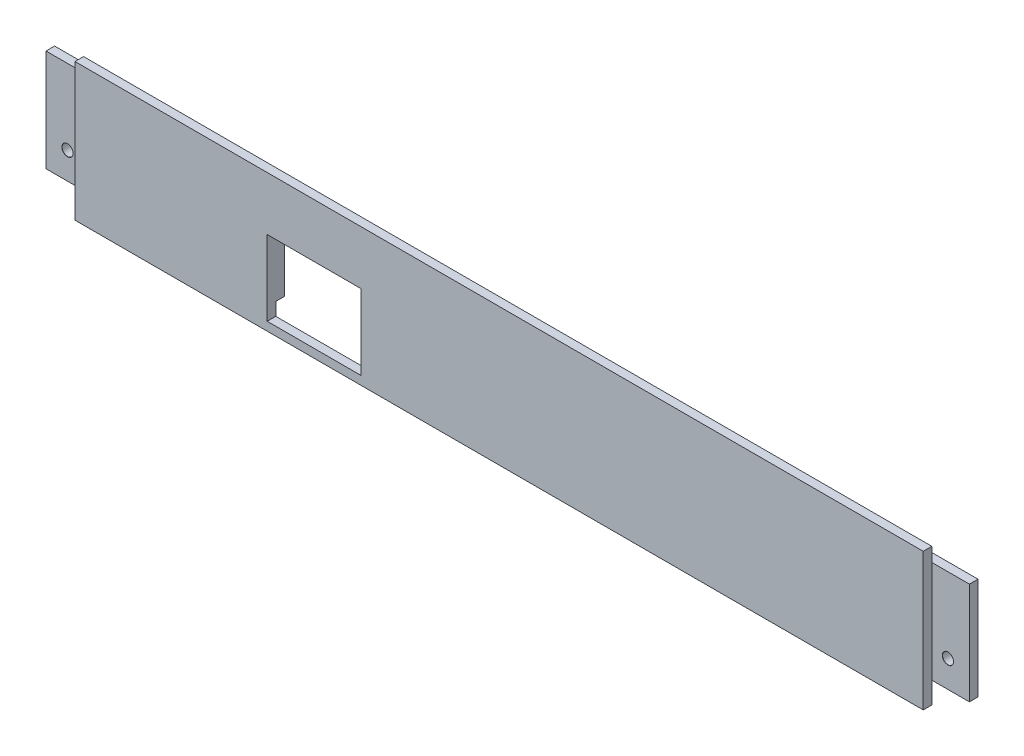
ISO-10303-21;
HEADER;
FILE_DESCRIPTION(('STEP AP214'),'2;1');
FILE_NAME('part.step','',(''),(''),'','','');
FILE_SCHEMA(('AUTOMOTIVE_DESIGN { 1 0 10303 214 1 1 1 1 }'));
ENDSEC;
DATA;
#1=APPLICATION_CONTEXT('core data for automotive mechanical design processes');
#2=APPLICATION_PROTOCOL_DEFINITION('international standard','automotive_design',2000,#1);
#3=PRODUCT_CONTEXT('',#1,'mechanical');
#4=PRODUCT('Part','Part','',(#3));
#5=PRODUCT_RELATED_PRODUCT_CATEGORY('part','',(#4));
#6=PRODUCT_DEFINITION_FORMATION('','',#4);
#7=PRODUCT_DEFINITION_CONTEXT('part definition',#1,'design');
#8=PRODUCT_DEFINITION('design','',#6,#7);
#9=PRODUCT_DEFINITION_SHAPE('','',#8);
#10=(LENGTH_UNIT() NAMED_UNIT(*) SI_UNIT(.MILLI.,.METRE.));
#11=(NAMED_UNIT(*) PLANE_ANGLE_UNIT() SI_UNIT($,.RADIAN.));
#12=(NAMED_UNIT(*) SI_UNIT($,.STERADIAN.) SOLID_ANGLE_UNIT());
#13=UNCERTAINTY_MEASURE_WITH_UNIT(LENGTH_MEASURE(1.E-05),#10,'distance_accuracy_value','');
#14=(GEOMETRIC_REPRESENTATION_CONTEXT(3) GLOBAL_UNCERTAINTY_ASSIGNED_CONTEXT((#13)) GLOBAL_UNIT_ASSIGNED_CONTEXT((#10,
#11,#12)) REPRESENTATION_CONTEXT('',''));
#15=CARTESIAN_POINT('',(0.,0.,0.));
#16=DIRECTION('',(0.,0.,1.));
#17=DIRECTION('',(1.,0.,0.));
#18=AXIS2_PLACEMENT_3D('',#15,#16,#17);
#19=CARTESIAN_POINT('',(0.,4.1,0.));
#20=DIRECTION('',(0.,1.,0.));
#21=DIRECTION('',(0.,0.,1.));
#22=AXIS2_PLACEMENT_3D('',#19,#20,#21);
#23=PLANE('',#22);
#24=DIRECTION('',(0.,0.,-1.));
#25=VECTOR('',#24,1.);
#26=CARTESIAN_POINT('',(70.9,4.1,0.));
#27=LINE('',#26,#25);
#28=CARTESIAN_POINT('',(70.9,4.1,0.));
#29=VERTEX_POINT('',#28);
#30=CARTESIAN_POINT('',(70.9,4.1,-7.00000000000001));
#31=VERTEX_POINT('',#30);
#32=EDGE_CURVE('E113',#29,#31,#27,.T.);
#33=ORIENTED_EDGE('',*,*,#32,.T.);
#34=DIRECTION('',(-1.,0.,0.));
#35=VECTOR('',#34,1.);
#36=CARTESIAN_POINT('',(70.9,4.1,-7.00000000000001));
#37=LINE('',#36,#35);
#38=CARTESIAN_POINT('',(63.9,4.1,-7.00000000000001));
#39=VERTEX_POINT('',#38);
#40=EDGE_CURVE('E82',#31,#39,#37,.T.);
#41=ORIENTED_EDGE('',*,*,#40,.T.);
#42=DIRECTION('',(0.,0.,1.));
#43=VECTOR('',#42,1.);
#44=CARTESIAN_POINT('',(63.9,4.1,0.));
#45=LINE('',#44,#43);
#46=CARTESIAN_POINT('',(63.9,4.1,0.));
#47=VERTEX_POINT('',#46);
#48=EDGE_CURVE('E121',#39,#47,#45,.T.);
#49=ORIENTED_EDGE('',*,*,#48,.T.);
#50=DIRECTION('',(1.,0.,0.));
#51=VECTOR('',#50,1.);
#52=CARTESIAN_POINT('',(70.9,4.1,0.));
#53=LINE('',#52,#51);
#54=EDGE_CURVE('E106',#47,#29,#53,.T.);
#55=ORIENTED_EDGE('',*,*,#54,.T.);
#56=EDGE_LOOP('',(#33,#41,#49,#55));
#57=FACE_BOUND('',#56,.T.);
#58=CARTESIAN_POINT('',(66.9,4.1,-4.51));
#59=DIRECTION('',(0.,1.,0.));
#60=DIRECTION('',(0.,0.,1.));
#61=AXIS2_PLACEMENT_3D('',#58,#59,#60);
#62=CIRCLE('',#61,1.29999999999999);
#63=CARTESIAN_POINT('',(66.9,4.1,-3.21000000000001));
#64=VERTEX_POINT('',#63);
#65=EDGE_CURVE('E53',#64,#64,#62,.T.);
#66=ORIENTED_EDGE('',*,*,#65,.F.);
#67=EDGE_LOOP('',(#66));
#68=FACE_BOUND('',#67,.T.);
#69=ADVANCED_FACE('F49',(#57,#68),#23,.T.);
#70=CARTESIAN_POINT('',(0.,1.6,0.));
#71=DIRECTION('',(0.,1.,0.));
#72=DIRECTION('',(0.,0.,1.));
#73=AXIS2_PLACEMENT_3D('',#70,#71,#72);
#74=PLANE('',#73);
#75=DIRECTION('',(0.,0.,-1.));
#76=VECTOR('',#75,1.);
#77=CARTESIAN_POINT('',(70.9,1.6,0.));
#78=LINE('',#77,#76);
#79=CARTESIAN_POINT('',(70.9,1.6,0.));
#80=VERTEX_POINT('',#79);
#81=CARTESIAN_POINT('',(70.9,1.6,-7.00000000000001));
#82=VERTEX_POINT('',#81);
#83=EDGE_CURVE('E112',#80,#82,#78,.T.);
#84=ORIENTED_EDGE('',*,*,#83,.F.);
#85=DIRECTION('',(1.,0.,0.));
#86=VECTOR('',#85,1.);
#87=CARTESIAN_POINT('',(70.9,1.6,0.));
#88=LINE('',#87,#86);
#89=CARTESIAN_POINT('',(63.9,1.6,0.));
#90=VERTEX_POINT('',#89);
#91=EDGE_CURVE('E92',#90,#80,#88,.T.);
#92=ORIENTED_EDGE('',*,*,#91,.F.);
#93=DIRECTION('',(0.,0.,1.));
#94=VECTOR('',#93,1.);
#95=CARTESIAN_POINT('',(63.9,1.6,0.));
#96=LINE('',#95,#94);
#97=CARTESIAN_POINT('',(63.9,1.6,-7.00000000000001));
#98=VERTEX_POINT('',#97);
#99=EDGE_CURVE('E98',#98,#90,#96,.T.);
#100=ORIENTED_EDGE('',*,*,#99,.F.);
#101=DIRECTION('',(-1.,0.,0.));
#102=VECTOR('',#101,1.);
#103=CARTESIAN_POINT('',(70.9,1.6,-7.00000000000001));
#104=LINE('',#103,#102);
#105=EDGE_CURVE('E66',#82,#98,#104,.T.);
#106=ORIENTED_EDGE('',*,*,#105,.F.);
#107=EDGE_LOOP('',(#84,#92,#100,#106));
#108=FACE_BOUND('',#107,.T.);
#109=CARTESIAN_POINT('',(66.9,1.6,-4.51));
#110=DIRECTION('',(0.,1.,0.));
#111=DIRECTION('',(0.,0.,1.));
#112=AXIS2_PLACEMENT_3D('',#109,#110,#111);
#113=CIRCLE('',#112,1.29999999999999);
#114=CARTESIAN_POINT('',(66.9,1.6,-3.21000000000001));
#115=VERTEX_POINT('',#114);
#116=EDGE_CURVE('E12',#115,#115,#113,.T.);
#117=ORIENTED_EDGE('',*,*,#116,.T.);
#118=EDGE_LOOP('',(#117));
#119=FACE_BOUND('',#118,.T.);
#120=ADVANCED_FACE('F109',(#108,#119),#74,.F.);
#121=CARTESIAN_POINT('',(70.9,4.1,0.));
#122=DIRECTION('',(-1.,0.,0.));
#123=DIRECTION('',(0.,0.,1.));
#124=AXIS2_PLACEMENT_3D('',#121,#122,#123);
#125=PLANE('',#124);
#126=ORIENTED_EDGE('',*,*,#83,.T.);
#127=DIRECTION('',(0.,-1.,0.));
#128=VECTOR('',#127,1.);
#129=CARTESIAN_POINT('',(70.9,4.1,-7.00000000000001));
#130=LINE('',#129,#128);
#131=EDGE_CURVE('E128',#31,#82,#130,.T.);
#132=ORIENTED_EDGE('',*,*,#131,.F.);
#133=ORIENTED_EDGE('',*,*,#32,.F.);
#134=DIRECTION('',(0.,-1.,0.));
#135=VECTOR('',#134,1.);
#136=CARTESIAN_POINT('',(70.9,4.1,0.));
#137=LINE('',#136,#135);
#138=EDGE_CURVE('E107',#29,#80,#137,.T.);
#139=ORIENTED_EDGE('',*,*,#138,.T.);
#140=EDGE_LOOP('',(#126,#132,#133,#139));
#141=FACE_BOUND('',#140,.T.);
#142=ADVANCED_FACE('F127',(#141),#125,.F.);
#143=CARTESIAN_POINT('',(70.9,4.1,-7.00000000000001));
#144=DIRECTION('',(0.,0.,1.));
#145=DIRECTION('',(1.,0.,0.));
#146=AXIS2_PLACEMENT_3D('',#143,#144,#145);
#147=PLANE('',#146);
#148=ORIENTED_EDGE('',*,*,#105,.T.);
#149=DIRECTION('',(0.,-1.,0.));
#150=VECTOR('',#149,1.);
#151=CARTESIAN_POINT('',(63.9,4.1,-7.00000000000001));
#152=LINE('',#151,#150);
#153=EDGE_CURVE('E103',#39,#98,#152,.T.);
#154=ORIENTED_EDGE('',*,*,#153,.F.);
#155=ORIENTED_EDGE('',*,*,#40,.F.);
#156=ORIENTED_EDGE('',*,*,#131,.T.);
#157=EDGE_LOOP('',(#148,#154,#155,#156));
#158=FACE_BOUND('',#157,.T.);
#159=ADVANCED_FACE('F131',(#158),#147,.F.);
#160=CARTESIAN_POINT('',(63.9,4.1,0.));
#161=DIRECTION('',(1.,0.,0.));
#162=DIRECTION('',(0.,0.,-1.));
#163=AXIS2_PLACEMENT_3D('',#160,#161,#162);
#164=PLANE('',#163);
#165=ORIENTED_EDGE('',*,*,#99,.T.);
#166=DIRECTION('',(0.,-1.,0.));
#167=VECTOR('',#166,1.);
#168=CARTESIAN_POINT('',(63.9,4.1,0.));
#169=LINE('',#168,#167);
#170=EDGE_CURVE('E101',#47,#90,#169,.T.);
#171=ORIENTED_EDGE('',*,*,#170,.F.);
#172=ORIENTED_EDGE('',*,*,#48,.F.);
#173=ORIENTED_EDGE('',*,*,#153,.T.);
#174=EDGE_LOOP('',(#165,#171,#172,#173));
#175=FACE_BOUND('',#174,.T.);
#176=ADVANCED_FACE('F99',(#175),#164,.F.);
#177=CARTESIAN_POINT('',(70.9,4.1,0.));
#178=DIRECTION('',(0.,0.,-1.));
#179=DIRECTION('',(-1.,0.,0.));
#180=AXIS2_PLACEMENT_3D('',#177,#178,#179);
#181=PLANE('',#180);
#182=ORIENTED_EDGE('',*,*,#91,.T.);
#183=ORIENTED_EDGE('',*,*,#138,.F.);
#184=ORIENTED_EDGE('',*,*,#54,.F.);
#185=ORIENTED_EDGE('',*,*,#170,.T.);
#186=EDGE_LOOP('',(#182,#183,#184,#185));
#187=FACE_BOUND('',#186,.T.);
#188=ADVANCED_FACE('F105',(#187),#181,.F.);
#189=CARTESIAN_POINT('',(66.9,4.1,-4.51));
#190=DIRECTION('',(0.,-1.,0.));
#191=DIRECTION('',(0.,0.,-1.));
#192=AXIS2_PLACEMENT_3D('',#189,#190,#191);
#193=CYLINDRICAL_SURFACE('',#192,1.29999999999999);
#194=ORIENTED_EDGE('',*,*,#65,.T.);
#195=EDGE_LOOP('',(#194));
#196=FACE_BOUND('',#195,.T.);
#197=ORIENTED_EDGE('',*,*,#116,.F.);
#198=EDGE_LOOP('',(#197));
#199=FACE_BOUND('',#198,.T.);
#200=ADVANCED_FACE('F51',(#196,#199),#193,.F.);
#201=CLOSED_SHELL('',(#69,#120,#142,#159,#176,#188,#200));
#202=MANIFOLD_SOLID_BREP('B2',#201);
#203=CARTESIAN_POINT('',(0.,4.1,0.));
#204=DIRECTION('',(0.,-1.,0.));
#205=DIRECTION('',(0.,0.,-1.));
#206=AXIS2_PLACEMENT_3D('',#203,#204,#205);
#207=PLANE('',#206);
#208=DIRECTION('',(0.,0.,1.));
#209=VECTOR('',#208,1.);
#210=CARTESIAN_POINT('',(-60.9,4.1,0.));
#211=LINE('',#210,#209);
#212=CARTESIAN_POINT('',(-60.9,4.1,-7.));
#213=VERTEX_POINT('',#212);
#214=CARTESIAN_POINT('',(-60.9,4.1,0.));
#215=VERTEX_POINT('',#214);
#216=EDGE_CURVE('E254',#213,#215,#211,.T.);
#217=ORIENTED_EDGE('',*,*,#216,.T.);
#218=DIRECTION('',(1.,0.,0.));
#219=VECTOR('',#218,1.);
#220=CARTESIAN_POINT('',(-60.9,4.1,0.));
#221=LINE('',#220,#219);
#222=CARTESIAN_POINT('',(-53.9,4.1,0.));
#223=VERTEX_POINT('',#222);
#224=EDGE_CURVE('E249',#215,#223,#221,.T.);
#225=ORIENTED_EDGE('',*,*,#224,.T.);
#226=DIRECTION('',(0.,0.,-1.));
#227=VECTOR('',#226,1.);
#228=CARTESIAN_POINT('',(-53.9,4.1,0.));
#229=LINE('',#228,#227);
#230=CARTESIAN_POINT('',(-53.9,4.1,-7.));
#231=VERTEX_POINT('',#230);
#232=EDGE_CURVE('E252',#223,#231,#229,.T.);
#233=ORIENTED_EDGE('',*,*,#232,.T.);
#234=DIRECTION('',(-1.,0.,0.));
#235=VECTOR('',#234,1.);
#236=CARTESIAN_POINT('',(-60.9,4.1,-7.));
#237=LINE('',#236,#235);
#238=EDGE_CURVE('E219',#231,#213,#237,.T.);
#239=ORIENTED_EDGE('',*,*,#238,.T.);
#240=EDGE_LOOP('',(#217,#225,#233,#239));
#241=FACE_BOUND('',#240,.T.);
#242=CARTESIAN_POINT('',(-56.9,4.1,-4.51));
#243=DIRECTION('',(0.,1.,0.));
#244=DIRECTION('',(0.,0.,1.));
#245=AXIS2_PLACEMENT_3D('',#242,#243,#244);
#246=CIRCLE('',#245,1.3);
#247=CARTESIAN_POINT('',(-56.9,4.1,-3.21));
#248=VERTEX_POINT('',#247);
#249=EDGE_CURVE('E269',#248,#248,#246,.T.);
#250=ORIENTED_EDGE('',*,*,#249,.F.);
#251=EDGE_LOOP('',(#250));
#252=FACE_BOUND('',#251,.T.);
#253=ADVANCED_FACE('F202',(#241,#252),#207,.F.);
#254=CARTESIAN_POINT('',(0.,1.6,0.));
#255=DIRECTION('',(0.,-1.,0.));
#256=DIRECTION('',(0.,0.,-1.));
#257=AXIS2_PLACEMENT_3D('',#254,#255,#256);
#258=PLANE('',#257);
#259=DIRECTION('',(0.,0.,1.));
#260=VECTOR('',#259,1.);
#261=CARTESIAN_POINT('',(-60.9,1.6,0.));
#262=LINE('',#261,#260);
#263=CARTESIAN_POINT('',(-60.9,1.6,-7.));
#264=VERTEX_POINT('',#263);
#265=CARTESIAN_POINT('',(-60.9,1.6,0.));
#266=VERTEX_POINT('',#265);
#267=EDGE_CURVE('E266',#264,#266,#262,.T.);
#268=ORIENTED_EDGE('',*,*,#267,.F.);
#269=DIRECTION('',(-1.,0.,0.));
#270=VECTOR('',#269,1.);
#271=CARTESIAN_POINT('',(-60.9,1.6,-7.));
#272=LINE('',#271,#270);
#273=CARTESIAN_POINT('',(-53.9,1.6,-7.));
#274=VERTEX_POINT('',#273);
#275=EDGE_CURVE('E242',#274,#264,#272,.T.);
#276=ORIENTED_EDGE('',*,*,#275,.F.);
#277=DIRECTION('',(0.,0.,-1.));
#278=VECTOR('',#277,1.);
#279=CARTESIAN_POINT('',(-53.9,1.6,0.));
#280=LINE('',#279,#278);
#281=CARTESIAN_POINT('',(-53.9,1.6,0.));
#282=VERTEX_POINT('',#281);
#283=EDGE_CURVE('E236',#282,#274,#280,.T.);
#284=ORIENTED_EDGE('',*,*,#283,.F.);
#285=DIRECTION('',(1.,0.,0.));
#286=VECTOR('',#285,1.);
#287=CARTESIAN_POINT('',(-60.9,1.6,0.));
#288=LINE('',#287,#286);
#289=EDGE_CURVE('E258',#266,#282,#288,.T.);
#290=ORIENTED_EDGE('',*,*,#289,.F.);
#291=EDGE_LOOP('',(#268,#276,#284,#290));
#292=FACE_BOUND('',#291,.T.);
#293=CARTESIAN_POINT('',(-56.9,1.6,-4.51));
#294=DIRECTION('',(0.,1.,0.));
#295=DIRECTION('',(0.,0.,1.));
#296=AXIS2_PLACEMENT_3D('',#293,#294,#295);
#297=CIRCLE('',#296,1.3);
#298=CARTESIAN_POINT('',(-56.9,1.6,-3.21));
#299=VERTEX_POINT('',#298);
#300=EDGE_CURVE('E281',#299,#299,#297,.T.);
#301=ORIENTED_EDGE('',*,*,#300,.T.);
#302=EDGE_LOOP('',(#301));
#303=FACE_BOUND('',#302,.T.);
#304=ADVANCED_FACE('F277',(#292,#303),#258,.T.);
#305=CARTESIAN_POINT('',(-60.9,4.1,0.));
#306=DIRECTION('',(1.,0.,0.));
#307=DIRECTION('',(0.,0.,-1.));
#308=AXIS2_PLACEMENT_3D('',#305,#306,#307);
#309=PLANE('',#308);
#310=ORIENTED_EDGE('',*,*,#267,.T.);
#311=DIRECTION('',(0.,-1.,0.));
#312=VECTOR('',#311,1.);
#313=CARTESIAN_POINT('',(-60.9,4.1,0.));
#314=LINE('',#313,#312);
#315=EDGE_CURVE('E47',#215,#266,#314,.T.);
#316=ORIENTED_EDGE('',*,*,#315,.F.);
#317=ORIENTED_EDGE('',*,*,#216,.F.);
#318=DIRECTION('',(0.,-1.,0.));
#319=VECTOR('',#318,1.);
#320=CARTESIAN_POINT('',(-60.9,4.1,-7.));
#321=LINE('',#320,#319);
#322=EDGE_CURVE('E262',#213,#264,#321,.T.);
#323=ORIENTED_EDGE('',*,*,#322,.T.);
#324=EDGE_LOOP('',(#310,#316,#317,#323));
#325=FACE_BOUND('',#324,.T.);
#326=ADVANCED_FACE('F204',(#325),#309,.F.);
#327=CARTESIAN_POINT('',(-60.9,4.1,0.));
#328=DIRECTION('',(0.,0.,-1.));
#329=DIRECTION('',(-1.,0.,0.));
#330=AXIS2_PLACEMENT_3D('',#327,#328,#329);
#331=PLANE('',#330);
#332=ORIENTED_EDGE('',*,*,#289,.T.);
#333=DIRECTION('',(0.,-1.,0.));
#334=VECTOR('',#333,1.);
#335=CARTESIAN_POINT('',(-53.9,4.1,0.));
#336=LINE('',#335,#334);
#337=EDGE_CURVE('E211',#223,#282,#336,.T.);
#338=ORIENTED_EDGE('',*,*,#337,.F.);
#339=ORIENTED_EDGE('',*,*,#224,.F.);
#340=ORIENTED_EDGE('',*,*,#315,.T.);
#341=EDGE_LOOP('',(#332,#338,#339,#340));
#342=FACE_BOUND('',#341,.T.);
#343=ADVANCED_FACE('F257',(#342),#331,.F.);
#344=CARTESIAN_POINT('',(-53.9,4.1,0.));
#345=DIRECTION('',(-1.,0.,0.));
#346=DIRECTION('',(0.,0.,1.));
#347=AXIS2_PLACEMENT_3D('',#344,#345,#346);
#348=PLANE('',#347);
#349=ORIENTED_EDGE('',*,*,#283,.T.);
#350=DIRECTION('',(0.,-1.,0.));
#351=VECTOR('',#350,1.);
#352=CARTESIAN_POINT('',(-53.9,4.1,-7.));
#353=LINE('',#352,#351);
#354=EDGE_CURVE('E259',#231,#274,#353,.T.);
#355=ORIENTED_EDGE('',*,*,#354,.F.);
#356=ORIENTED_EDGE('',*,*,#232,.F.);
#357=ORIENTED_EDGE('',*,*,#337,.T.);
#358=EDGE_LOOP('',(#349,#355,#356,#357));
#359=FACE_BOUND('',#358,.T.);
#360=ADVANCED_FACE('F260',(#359),#348,.F.);
#361=CARTESIAN_POINT('',(-60.9,4.1,-7.));
#362=DIRECTION('',(0.,0.,1.));
#363=DIRECTION('',(1.,0.,0.));
#364=AXIS2_PLACEMENT_3D('',#361,#362,#363);
#365=PLANE('',#364);
#366=ORIENTED_EDGE('',*,*,#275,.T.);
#367=ORIENTED_EDGE('',*,*,#322,.F.);
#368=ORIENTED_EDGE('',*,*,#238,.F.);
#369=ORIENTED_EDGE('',*,*,#354,.T.);
#370=EDGE_LOOP('',(#366,#367,#368,#369));
#371=FACE_BOUND('',#370,.T.);
#372=ADVANCED_FACE('F274',(#371),#365,.F.);
#373=CARTESIAN_POINT('',(-56.9,4.1,-4.51));
#374=DIRECTION('',(0.,-1.,0.));
#375=DIRECTION('',(0.,0.,-1.));
#376=AXIS2_PLACEMENT_3D('',#373,#374,#375);
#377=CYLINDRICAL_SURFACE('',#376,1.3);
#378=ORIENTED_EDGE('',*,*,#249,.T.);
#379=EDGE_LOOP('',(#378));
#380=FACE_BOUND('',#379,.T.);
#381=ORIENTED_EDGE('',*,*,#300,.F.);
#382=EDGE_LOOP('',(#381));
#383=FACE_BOUND('',#382,.T.);
#384=ADVANCED_FACE('F287',(#380,#383),#377,.F.);
#385=CLOSED_SHELL('',(#253,#304,#326,#343,#360,#372,#384));
#386=MANIFOLD_SOLID_BREP('B6',#385);
#387=CARTESIAN_POINT('',(-86.,4.00000000000002,-1.6));
#388=DIRECTION('',(0.,-1.,0.));
#389=DIRECTION('',(0.,0.,-1.));
#390=AXIS2_PLACEMENT_3D('',#387,#388,#389);
#391=PLANE('',#390);
#392=DIRECTION('',(0.,0.,-1.));
#393=VECTOR('',#392,1.);
#394=CARTESIAN_POINT('',(-43.2,4.00000000000002,-1.6));
#395=LINE('',#394,#393);
#396=CARTESIAN_POINT('',(-43.2,4.00000000000002,0.));
#397=VERTEX_POINT('',#396);
#398=CARTESIAN_POINT('',(-43.2,4.00000000000002,-1.6));
#399=VERTEX_POINT('',#398);
#400=EDGE_CURVE('E491',#397,#399,#395,.T.);
#401=ORIENTED_EDGE('',*,*,#400,.F.);
#402=DIRECTION('',(1.,0.,0.));
#403=VECTOR('',#402,1.);
#404=CARTESIAN_POINT('',(-86.,4.00000000000002,0.));
#405=LINE('',#404,#403);
#406=CARTESIAN_POINT('',(-79.,4.00000000000002,0.));
#407=VERTEX_POINT('',#406);
#408=EDGE_CURVE('E540',#407,#397,#405,.T.);
#409=ORIENTED_EDGE('',*,*,#408,.F.);
#410=CARTESIAN_POINT('',(-86.,4.00000000000002,0.));
#411=VERTEX_POINT('',#410);
#412=EDGE_CURVE('E535',#411,#407,#405,.T.);
#413=ORIENTED_EDGE('',*,*,#412,.F.);
#414=DIRECTION('',(0.,0.,1.));
#415=VECTOR('',#414,1.);
#416=CARTESIAN_POINT('',(-86.,4.00000000000002,-1.6));
#417=LINE('',#416,#415);
#418=CARTESIAN_POINT('',(-86.,4.00000000000002,-1.6));
#419=VERTEX_POINT('',#418);
#420=EDGE_CURVE('E531',#419,#411,#417,.T.);
#421=ORIENTED_EDGE('',*,*,#420,.F.);
#422=DIRECTION('',(1.,0.,0.));
#423=VECTOR('',#422,1.);
#424=CARTESIAN_POINT('',(-86.,4.00000000000002,-1.6));
#425=LINE('',#424,#423);
#426=EDGE_CURVE('E522',#419,#399,#425,.T.);
#427=ORIENTED_EDGE('',*,*,#426,.T.);
#428=EDGE_LOOP('',(#401,#409,#413,#421,#427));
#429=FACE_BOUND('',#428,.T.);
#430=ADVANCED_FACE('F347',(#429),#391,.T.);
#431=CARTESIAN_POINT('',(0.,0.,0.));
#432=DIRECTION('',(0.,0.,1.));
#433=DIRECTION('',(1.,0.,0.));
#434=AXIS2_PLACEMENT_3D('',#431,#432,#433);
#435=PLANE('',#434);
#436=ORIENTED_EDGE('',*,*,#408,.T.);
#437=DIRECTION('',(0.,-1.,0.));
#438=VECTOR('',#437,1.);
#439=CARTESIAN_POINT('',(-43.2,0.,0.));
#440=LINE('',#439,#438);
#441=CARTESIAN_POINT('',(-43.2,1.6,0.));
#442=VERTEX_POINT('',#441);
#443=EDGE_CURVE('E493',#397,#442,#440,.T.);
#444=ORIENTED_EDGE('',*,*,#443,.T.);
#445=DIRECTION('',(1.,0.,0.));
#446=VECTOR('',#445,1.);
#447=CARTESIAN_POINT('',(0.,1.6,0.));
#448=LINE('',#447,#446);
#449=CARTESIAN_POINT('',(-25.7,1.6,0.));
#450=VERTEX_POINT('',#449);
#451=EDGE_CURVE('E496',#442,#450,#448,.T.);
#452=ORIENTED_EDGE('',*,*,#451,.T.);
#453=DIRECTION('',(0.,1.,0.));
#454=VECTOR('',#453,1.);
#455=CARTESIAN_POINT('',(-25.7,0.,0.));
#456=LINE('',#455,#454);
#457=CARTESIAN_POINT('',(-25.7,4.00000000000002,0.));
#458=VERTEX_POINT('',#457);
#459=EDGE_CURVE('E466',#450,#458,#456,.T.);
#460=ORIENTED_EDGE('',*,*,#459,.T.);
#461=CARTESIAN_POINT('',(79.,4.00000000000002,0.));
#462=VERTEX_POINT('',#461);
#463=EDGE_CURVE('E539',#458,#462,#405,.T.);
#464=ORIENTED_EDGE('',*,*,#463,.T.);
#465=DIRECTION('',(0.,1.,0.));
#466=VECTOR('',#465,1.);
#467=CARTESIAN_POINT('',(79.,25.6,0.));
#468=LINE('',#467,#466);
#469=CARTESIAN_POINT('',(79.,0.,0.));
#470=VERTEX_POINT('',#469);
#471=EDGE_CURVE('E575',#470,#462,#468,.T.);
#472=ORIENTED_EDGE('',*,*,#471,.F.);
#473=DIRECTION('',(1.,0.,0.));
#474=VECTOR('',#473,1.);
#475=CARTESIAN_POINT('',(-79.,0.,0.));
#476=LINE('',#475,#474);
#477=CARTESIAN_POINT('',(-79.,0.,0.));
#478=VERTEX_POINT('',#477);
#479=EDGE_CURVE('E571',#478,#470,#476,.T.);
#480=ORIENTED_EDGE('',*,*,#479,.F.);
#481=DIRECTION('',(0.,-1.,0.));
#482=VECTOR('',#481,1.);
#483=CARTESIAN_POINT('',(-79.,25.6,0.));
#484=LINE('',#483,#482);
#485=EDGE_CURVE('E550',#407,#478,#484,.T.);
#486=ORIENTED_EDGE('',*,*,#485,.F.);
#487=EDGE_LOOP('',(#436,#444,#452,#460,#464,#472,#480,#486));
#488=FACE_BOUND('',#487,.T.);
#489=ADVANCED_FACE('F608',(#488),#435,.F.);
#490=CARTESIAN_POINT('',(-79.,25.6,1.6));
#491=DIRECTION('',(1.,0.,0.));
#492=DIRECTION('',(0.,0.,-1.));
#493=AXIS2_PLACEMENT_3D('',#490,#491,#492);
#494=PLANE('',#493);
#495=CARTESIAN_POINT('',(-79.,25.6,0.));
#496=VERTEX_POINT('',#495);
#497=CARTESIAN_POINT('',(-79.,23.,0.));
#498=VERTEX_POINT('',#497);
#499=EDGE_CURVE('E568',#496,#498,#484,.T.);
#500=ORIENTED_EDGE('',*,*,#499,.T.);
#501=EDGE_CURVE('E572',#498,#407,#484,.T.);
#502=ORIENTED_EDGE('',*,*,#501,.T.);
#503=ORIENTED_EDGE('',*,*,#485,.T.);
#504=DIRECTION('',(0.,0.,-1.));
#505=VECTOR('',#504,1.);
#506=CARTESIAN_POINT('',(-79.,0.,1.6));
#507=LINE('',#506,#505);
#508=CARTESIAN_POINT('',(-79.,0.,1.6));
#509=VERTEX_POINT('',#508);
#510=EDGE_CURVE('E588',#509,#478,#507,.T.);
#511=ORIENTED_EDGE('',*,*,#510,.F.);
#512=DIRECTION('',(0.,-1.,0.));
#513=VECTOR('',#512,1.);
#514=CARTESIAN_POINT('',(-79.,25.6,1.6));
#515=LINE('',#514,#513);
#516=CARTESIAN_POINT('',(-79.,25.6,1.6));
#517=VERTEX_POINT('',#516);
#518=EDGE_CURVE('E557',#517,#509,#515,.T.);
#519=ORIENTED_EDGE('',*,*,#518,.F.);
#520=DIRECTION('',(0.,0.,-1.));
#521=VECTOR('',#520,1.);
#522=CARTESIAN_POINT('',(-79.,25.6,1.6));
#523=LINE('',#522,#521);
#524=EDGE_CURVE('E567',#517,#496,#523,.T.);
#525=ORIENTED_EDGE('',*,*,#524,.T.);
#526=EDGE_LOOP('',(#500,#502,#503,#511,#519,#525));
#527=FACE_BOUND('',#526,.T.);
#528=ADVANCED_FACE('F349',(#527),#494,.F.);
#529=CARTESIAN_POINT('',(-79.,0.,1.6));
#530=DIRECTION('',(0.,1.,0.));
#531=DIRECTION('',(-1.,0.,0.));
#532=AXIS2_PLACEMENT_3D('',#529,#530,#531);
#533=PLANE('',#532);
#534=ORIENTED_EDGE('',*,*,#479,.T.);
#535=DIRECTION('',(0.,0.,-1.));
#536=VECTOR('',#535,1.);
#537=CARTESIAN_POINT('',(79.,0.,1.6));
#538=LINE('',#537,#536);
#539=CARTESIAN_POINT('',(79.,0.,1.6));
#540=VERTEX_POINT('',#539);
#541=EDGE_CURVE('E585',#540,#470,#538,.T.);
#542=ORIENTED_EDGE('',*,*,#541,.F.);
#543=DIRECTION('',(1.,0.,0.));
#544=VECTOR('',#543,1.);
#545=CARTESIAN_POINT('',(-79.,0.,1.6));
#546=LINE('',#545,#544);
#547=EDGE_CURVE('E560',#509,#540,#546,.T.);
#548=ORIENTED_EDGE('',*,*,#547,.F.);
#549=ORIENTED_EDGE('',*,*,#510,.T.);
#550=EDGE_LOOP('',(#534,#542,#548,#549));
#551=FACE_BOUND('',#550,.T.);
#552=ADVANCED_FACE('F652',(#551),#533,.F.);
#553=CARTESIAN_POINT('',(79.,25.6,1.6));
#554=DIRECTION('',(-1.,0.,0.));
#555=DIRECTION('',(0.,-1.,0.));
#556=AXIS2_PLACEMENT_3D('',#553,#554,#555);
#557=PLANE('',#556);
#558=ORIENTED_EDGE('',*,*,#471,.T.);
#559=CARTESIAN_POINT('',(79.,23.,0.));
#560=VERTEX_POINT('',#559);
#561=EDGE_CURVE('E578',#462,#560,#468,.T.);
#562=ORIENTED_EDGE('',*,*,#561,.T.);
#563=CARTESIAN_POINT('',(79.,25.6,0.));
#564=VERTEX_POINT('',#563);
#565=EDGE_CURVE('E574',#560,#564,#468,.T.);
#566=ORIENTED_EDGE('',*,*,#565,.T.);
#567=DIRECTION('',(0.,0.,-1.));
#568=VECTOR('',#567,1.);
#569=CARTESIAN_POINT('',(79.,25.6,1.6));
#570=LINE('',#569,#568);
#571=CARTESIAN_POINT('',(79.,25.6,1.6));
#572=VERTEX_POINT('',#571);
#573=EDGE_CURVE('E582',#572,#564,#570,.T.);
#574=ORIENTED_EDGE('',*,*,#573,.F.);
#575=DIRECTION('',(0.,1.,0.));
#576=VECTOR('',#575,1.);
#577=CARTESIAN_POINT('',(79.,25.6,1.6));
#578=LINE('',#577,#576);
#579=EDGE_CURVE('E563',#540,#572,#578,.T.);
#580=ORIENTED_EDGE('',*,*,#579,.F.);
#581=ORIENTED_EDGE('',*,*,#541,.T.);
#582=EDGE_LOOP('',(#558,#562,#566,#574,#580,#581));
#583=FACE_BOUND('',#582,.T.);
#584=ADVANCED_FACE('F637',(#583),#557,.F.);
#585=CARTESIAN_POINT('',(-79.,25.6,1.6));
#586=DIRECTION('',(0.,-1.,0.));
#587=DIRECTION('',(1.,0.,0.));
#588=AXIS2_PLACEMENT_3D('',#585,#586,#587);
#589=PLANE('',#588);
#590=DIRECTION('',(-1.,0.,0.));
#591=VECTOR('',#590,1.);
#592=CARTESIAN_POINT('',(-79.,25.6,0.));
#593=LINE('',#592,#591);
#594=EDGE_CURVE('E561',#564,#496,#593,.T.);
#595=ORIENTED_EDGE('',*,*,#594,.T.);
#596=ORIENTED_EDGE('',*,*,#524,.F.);
#597=DIRECTION('',(-1.,0.,0.));
#598=VECTOR('',#597,1.);
#599=CARTESIAN_POINT('',(-79.,25.6,1.6));
#600=LINE('',#599,#598);
#601=EDGE_CURVE('E565',#572,#517,#600,.T.);
#602=ORIENTED_EDGE('',*,*,#601,.F.);
#603=ORIENTED_EDGE('',*,*,#573,.T.);
#604=EDGE_LOOP('',(#595,#596,#602,#603));
#605=FACE_BOUND('',#604,.T.);
#606=ADVANCED_FACE('F656',(#605),#589,.F.);
#607=CARTESIAN_POINT('',(0.,0.,1.6));
#608=DIRECTION('',(0.,0.,1.));
#609=DIRECTION('',(1.,0.,0.));
#610=AXIS2_PLACEMENT_3D('',#607,#608,#609);
#611=PLANE('',#610);
#612=DIRECTION('',(0.,-1.,0.));
#613=VECTOR('',#612,1.);
#614=CARTESIAN_POINT('',(-43.2,15.6,1.6));
#615=LINE('',#614,#613);
#616=CARTESIAN_POINT('',(-43.2,15.6,1.6));
#617=VERTEX_POINT('',#616);
#618=CARTESIAN_POINT('',(-43.2,1.6,1.6));
#619=VERTEX_POINT('',#618);
#620=EDGE_CURVE('E362',#617,#619,#615,.T.);
#621=ORIENTED_EDGE('',*,*,#620,.F.);
#622=DIRECTION('',(-1.,0.,0.));
#623=VECTOR('',#622,1.);
#624=CARTESIAN_POINT('',(-43.2,15.6,1.6));
#625=LINE('',#624,#623);
#626=CARTESIAN_POINT('',(-25.7,15.6,1.6));
#627=VERTEX_POINT('',#626);
#628=EDGE_CURVE('E479',#627,#617,#625,.T.);
#629=ORIENTED_EDGE('',*,*,#628,.F.);
#630=DIRECTION('',(0.,1.,0.));
#631=VECTOR('',#630,1.);
#632=CARTESIAN_POINT('',(-25.7,15.6,1.6));
#633=LINE('',#632,#631);
#634=CARTESIAN_POINT('',(-25.7,1.6,1.6));
#635=VERTEX_POINT('',#634);
#636=EDGE_CURVE('E463',#635,#627,#633,.T.);
#637=ORIENTED_EDGE('',*,*,#636,.F.);
#638=DIRECTION('',(1.,0.,0.));
#639=VECTOR('',#638,1.);
#640=CARTESIAN_POINT('',(-43.2,1.6,1.6));
#641=LINE('',#640,#639);
#642=EDGE_CURVE('E472',#619,#635,#641,.T.);
#643=ORIENTED_EDGE('',*,*,#642,.F.);
#644=EDGE_LOOP('',(#621,#629,#637,#643));
#645=FACE_BOUND('',#644,.T.);
#646=ORIENTED_EDGE('',*,*,#518,.T.);
#647=ORIENTED_EDGE('',*,*,#547,.T.);
#648=ORIENTED_EDGE('',*,*,#579,.T.);
#649=ORIENTED_EDGE('',*,*,#601,.T.);
#650=EDGE_LOOP('',(#646,#647,#648,#649));
#651=FACE_BOUND('',#650,.T.);
#652=ADVANCED_FACE('F476',(#645,#651),#611,.T.);
#653=ORIENTED_EDGE('',*,*,#565,.F.);
#654=DIRECTION('',(-1.,0.,0.));
#655=VECTOR('',#654,1.);
#656=CARTESIAN_POINT('',(-86.,23.,0.));
#657=LINE('',#656,#655);
#658=EDGE_CURVE('E546',#560,#498,#657,.T.);
#659=ORIENTED_EDGE('',*,*,#658,.T.);
#660=ORIENTED_EDGE('',*,*,#499,.F.);
#661=ORIENTED_EDGE('',*,*,#594,.F.);
#662=EDGE_LOOP('',(#653,#659,#660,#661));
#663=FACE_BOUND('',#662,.T.);
#664=ADVANCED_FACE('F633',(#663),#435,.F.);
#665=CARTESIAN_POINT('',(0.,0.,0.));
#666=DIRECTION('',(0.,0.,1.));
#667=DIRECTION('',(1.,0.,0.));
#668=AXIS2_PLACEMENT_3D('',#665,#666,#667);
#669=PLANE('',#668);
#670=CARTESIAN_POINT('',(-82.,9.,0.));
#671=DIRECTION('',(0.,0.,1.));
#672=DIRECTION('',(1.,0.,0.));
#673=AXIS2_PLACEMENT_3D('',#670,#671,#672);
#674=CIRCLE('',#673,1.05);
#675=CARTESIAN_POINT('',(-80.95,9.,0.));
#676=VERTEX_POINT('',#675);
#677=EDGE_CURVE('E498',#676,#676,#674,.T.);
#678=ORIENTED_EDGE('',*,*,#677,.F.);
#679=EDGE_LOOP('',(#678));
#680=FACE_BOUND('',#679,.T.);
#681=ORIENTED_EDGE('',*,*,#501,.F.);
#682=CARTESIAN_POINT('',(-86.,23.,0.));
#683=VERTEX_POINT('',#682);
#684=EDGE_CURVE('E543',#498,#683,#657,.T.);
#685=ORIENTED_EDGE('',*,*,#684,.T.);
#686=DIRECTION('',(0.,-1.,0.));
#687=VECTOR('',#686,1.);
#688=CARTESIAN_POINT('',(-86.,23.,0.));
#689=LINE('',#688,#687);
#690=EDGE_CURVE('E516',#683,#411,#689,.T.);
#691=ORIENTED_EDGE('',*,*,#690,.T.);
#692=ORIENTED_EDGE('',*,*,#412,.T.);
#693=EDGE_LOOP('',(#681,#685,#691,#692));
#694=FACE_BOUND('',#693,.T.);
#695=ADVANCED_FACE('F647',(#680,#694),#669,.T.);
#696=CARTESIAN_POINT('',(82.,9.,0.));
#697=DIRECTION('',(0.,0.,1.));
#698=DIRECTION('',(1.,0.,0.));
#699=AXIS2_PLACEMENT_3D('',#696,#697,#698);
#700=CIRCLE('',#699,1.05);
#701=CARTESIAN_POINT('',(83.05,9.,0.));
#702=VERTEX_POINT('',#701);
#703=EDGE_CURVE('E507',#702,#702,#700,.T.);
#704=ORIENTED_EDGE('',*,*,#703,.F.);
#705=EDGE_LOOP('',(#704));
#706=FACE_BOUND('',#705,.T.);
#707=ORIENTED_EDGE('',*,*,#561,.F.);
#708=CARTESIAN_POINT('',(86.,4.00000000000002,0.));
#709=VERTEX_POINT('',#708);
#710=EDGE_CURVE('E534',#462,#709,#405,.T.);
#711=ORIENTED_EDGE('',*,*,#710,.T.);
#712=DIRECTION('',(0.,1.,0.));
#713=VECTOR('',#712,1.);
#714=CARTESIAN_POINT('',(86.,23.,0.));
#715=LINE('',#714,#713);
#716=CARTESIAN_POINT('',(86.,23.,0.));
#717=VERTEX_POINT('',#716);
#718=EDGE_CURVE('E538',#709,#717,#715,.T.);
#719=ORIENTED_EDGE('',*,*,#718,.T.);
#720=EDGE_CURVE('E521',#717,#560,#657,.T.);
#721=ORIENTED_EDGE('',*,*,#720,.T.);
#722=EDGE_LOOP('',(#707,#711,#719,#721));
#723=FACE_BOUND('',#722,.T.);
#724=ADVANCED_FACE('F614',(#706,#723),#669,.T.);
#725=CARTESIAN_POINT('',(-86.,23.,-1.6));
#726=DIRECTION('',(-1.,0.,0.));
#727=DIRECTION('',(0.,0.,1.));
#728=AXIS2_PLACEMENT_3D('',#725,#726,#727);
#729=PLANE('',#728);
#730=ORIENTED_EDGE('',*,*,#690,.F.);
#731=DIRECTION('',(0.,0.,1.));
#732=VECTOR('',#731,1.);
#733=CARTESIAN_POINT('',(-86.,23.,-1.6));
#734=LINE('',#733,#732);
#735=CARTESIAN_POINT('',(-86.,23.,-1.6));
#736=VERTEX_POINT('',#735);
#737=EDGE_CURVE('E547',#736,#683,#734,.T.);
#738=ORIENTED_EDGE('',*,*,#737,.F.);
#739=DIRECTION('',(0.,-1.,0.));
#740=VECTOR('',#739,1.);
#741=CARTESIAN_POINT('',(-86.,23.,-1.6));
#742=LINE('',#741,#740);
#743=EDGE_CURVE('E517',#736,#419,#742,.T.);
#744=ORIENTED_EDGE('',*,*,#743,.T.);
#745=ORIENTED_EDGE('',*,*,#420,.T.);
#746=EDGE_LOOP('',(#730,#738,#744,#745));
#747=FACE_BOUND('',#746,.T.);
#748=ADVANCED_FACE('F644',(#747),#729,.T.);
#749=CARTESIAN_POINT('',(-86.,23.,-1.6));
#750=DIRECTION('',(0.,1.,0.));
#751=DIRECTION('',(-1.,0.,0.));
#752=AXIS2_PLACEMENT_3D('',#749,#750,#751);
#753=PLANE('',#752);
#754=ORIENTED_EDGE('',*,*,#720,.F.);
#755=DIRECTION('',(0.,0.,1.));
#756=VECTOR('',#755,1.);
#757=CARTESIAN_POINT('',(86.,23.,-1.6));
#758=LINE('',#757,#756);
#759=CARTESIAN_POINT('',(86.,23.,-1.6));
#760=VERTEX_POINT('',#759);
#761=EDGE_CURVE('E551',#760,#717,#758,.T.);
#762=ORIENTED_EDGE('',*,*,#761,.F.);
#763=DIRECTION('',(-1.,0.,0.));
#764=VECTOR('',#763,1.);
#765=CARTESIAN_POINT('',(-86.,23.,-1.6));
#766=LINE('',#765,#764);
#767=EDGE_CURVE('E528',#760,#736,#766,.T.);
#768=ORIENTED_EDGE('',*,*,#767,.T.);
#769=ORIENTED_EDGE('',*,*,#737,.T.);
#770=ORIENTED_EDGE('',*,*,#684,.F.);
#771=ORIENTED_EDGE('',*,*,#658,.F.);
#772=EDGE_LOOP('',(#754,#762,#768,#769,#770,#771));
#773=FACE_BOUND('',#772,.T.);
#774=ADVANCED_FACE('F628',(#773),#753,.T.);
#775=CARTESIAN_POINT('',(86.,23.,-1.6));
#776=DIRECTION('',(1.,0.,0.));
#777=DIRECTION('',(0.,0.,-1.));
#778=AXIS2_PLACEMENT_3D('',#775,#776,#777);
#779=PLANE('',#778);
#780=ORIENTED_EDGE('',*,*,#718,.F.);
#781=DIRECTION('',(0.,0.,1.));
#782=VECTOR('',#781,1.);
#783=CARTESIAN_POINT('',(86.,4.00000000000002,-1.6));
#784=LINE('',#783,#782);
#785=CARTESIAN_POINT('',(86.,4.00000000000002,-1.6));
#786=VERTEX_POINT('',#785);
#787=EDGE_CURVE('E553',#786,#709,#784,.T.);
#788=ORIENTED_EDGE('',*,*,#787,.F.);
#789=DIRECTION('',(0.,1.,0.));
#790=VECTOR('',#789,1.);
#791=CARTESIAN_POINT('',(86.,23.,-1.6));
#792=LINE('',#791,#790);
#793=EDGE_CURVE('E525',#786,#760,#792,.T.);
#794=ORIENTED_EDGE('',*,*,#793,.T.);
#795=ORIENTED_EDGE('',*,*,#761,.T.);
#796=EDGE_LOOP('',(#780,#788,#794,#795));
#797=FACE_BOUND('',#796,.T.);
#798=ADVANCED_FACE('F625',(#797),#779,.T.);
#799=DIRECTION('',(0.,0.,1.));
#800=VECTOR('',#799,1.);
#801=CARTESIAN_POINT('',(-25.7,4.00000000000002,-1.6));
#802=LINE('',#801,#800);
#803=CARTESIAN_POINT('',(-25.7,4.00000000000002,-1.6));
#804=VERTEX_POINT('',#803);
#805=EDGE_CURVE('E486',#804,#458,#802,.T.);
#806=ORIENTED_EDGE('',*,*,#805,.F.);
#807=EDGE_CURVE('E520',#804,#786,#425,.T.);
#808=ORIENTED_EDGE('',*,*,#807,.T.);
#809=ORIENTED_EDGE('',*,*,#787,.T.);
#810=ORIENTED_EDGE('',*,*,#710,.F.);
#811=ORIENTED_EDGE('',*,*,#463,.F.);
#812=EDGE_LOOP('',(#806,#808,#809,#810,#811));
#813=FACE_BOUND('',#812,.T.);
#814=ADVANCED_FACE('F622',(#813),#391,.T.);
#815=CARTESIAN_POINT('',(0.,0.,-1.6));
#816=DIRECTION('',(0.,0.,1.));
#817=DIRECTION('',(1.,0.,0.));
#818=AXIS2_PLACEMENT_3D('',#815,#816,#817);
#819=PLANE('',#818);
#820=CARTESIAN_POINT('',(-82.,9.,-1.6));
#821=DIRECTION('',(0.,0.,1.));
#822=DIRECTION('',(1.,0.,0.));
#823=AXIS2_PLACEMENT_3D('',#820,#821,#822);
#824=CIRCLE('',#823,1.02499999999998);
#825=CARTESIAN_POINT('',(-80.975,9.,-1.6));
#826=VERTEX_POINT('',#825);
#827=EDGE_CURVE('E504',#826,#826,#824,.T.);
#828=ORIENTED_EDGE('',*,*,#827,.T.);
#829=EDGE_LOOP('',(#828));
#830=FACE_BOUND('',#829,.T.);
#831=CARTESIAN_POINT('',(82.,9.,-1.6));
#832=DIRECTION('',(0.,0.,1.));
#833=DIRECTION('',(1.,0.,0.));
#834=AXIS2_PLACEMENT_3D('',#831,#832,#833);
#835=CIRCLE('',#834,1.02499999999998);
#836=CARTESIAN_POINT('',(83.025,9.,-1.6));
#837=VERTEX_POINT('',#836);
#838=EDGE_CURVE('E513',#837,#837,#835,.T.);
#839=ORIENTED_EDGE('',*,*,#838,.T.);
#840=EDGE_LOOP('',(#839));
#841=FACE_BOUND('',#840,.T.);
#842=DIRECTION('',(-1.,0.,0.));
#843=VECTOR('',#842,1.);
#844=CARTESIAN_POINT('',(0.,15.6,-1.6));
#845=LINE('',#844,#843);
#846=CARTESIAN_POINT('',(-25.7,15.6,-1.6));
#847=VERTEX_POINT('',#846);
#848=CARTESIAN_POINT('',(-43.2,15.6,-1.6));
#849=VERTEX_POINT('',#848);
#850=EDGE_CURVE('E355',#847,#849,#845,.T.);
#851=ORIENTED_EDGE('',*,*,#850,.T.);
#852=DIRECTION('',(0.,-1.,0.));
#853=VECTOR('',#852,1.);
#854=CARTESIAN_POINT('',(-43.2,0.,-1.6));
#855=LINE('',#854,#853);
#856=EDGE_CURVE('E200',#849,#399,#855,.T.);
#857=ORIENTED_EDGE('',*,*,#856,.T.);
#858=ORIENTED_EDGE('',*,*,#426,.F.);
#859=ORIENTED_EDGE('',*,*,#743,.F.);
#860=ORIENTED_EDGE('',*,*,#767,.F.);
#861=ORIENTED_EDGE('',*,*,#793,.F.);
#862=ORIENTED_EDGE('',*,*,#807,.F.);
#863=DIRECTION('',(0.,1.,0.));
#864=VECTOR('',#863,1.);
#865=CARTESIAN_POINT('',(-25.7,0.,-1.6));
#866=LINE('',#865,#864);
#867=EDGE_CURVE('E591',#804,#847,#866,.T.);
#868=ORIENTED_EDGE('',*,*,#867,.T.);
#869=EDGE_LOOP('',(#851,#857,#858,#859,#860,#861,#862,#868));
#870=FACE_BOUND('',#869,.T.);
#871=ADVANCED_FACE('F595',(#830,#841,#870),#819,.F.);
#872=CARTESIAN_POINT('',(82.,9.,0.));
#873=DIRECTION('',(0.,0.,1.));
#874=DIRECTION('',(1.,0.,0.));
#875=AXIS2_PLACEMENT_3D('',#872,#873,#874);
#876=CYLINDRICAL_SURFACE('',#875,1.02499999999998);
#877=ORIENTED_EDGE('',*,*,#838,.F.);
#878=EDGE_LOOP('',(#877));
#879=FACE_BOUND('',#878,.T.);
#880=CARTESIAN_POINT('',(82.,9.,-0.0249999999999972));
#881=DIRECTION('',(0.,0.,1.));
#882=DIRECTION('',(1.,0.,0.));
#883=AXIS2_PLACEMENT_3D('',#880,#881,#882);
#884=CIRCLE('',#883,1.02499999999998);
#885=CARTESIAN_POINT('',(83.025,9.,-0.0249999999999972));
#886=VERTEX_POINT('',#885);
#887=EDGE_CURVE('E510',#886,#886,#884,.T.);
#888=ORIENTED_EDGE('',*,*,#887,.T.);
#889=EDGE_LOOP('',(#888));
#890=FACE_BOUND('',#889,.T.);
#891=ADVANCED_FACE('F680',(#879,#890),#876,.F.);
#892=CARTESIAN_POINT('',(82.,9.,0.));
#893=DIRECTION('',(0.,0.,1.));
#894=DIRECTION('',(1.,0.,0.));
#895=AXIS2_PLACEMENT_3D('',#892,#893,#894);
#896=CONICAL_SURFACE('',#895,1.05,0.785398163397691);
#897=ORIENTED_EDGE('',*,*,#887,.F.);
#898=EDGE_LOOP('',(#897));
#899=FACE_BOUND('',#898,.T.);
#900=ORIENTED_EDGE('',*,*,#703,.T.);
#901=EDGE_LOOP('',(#900));
#902=FACE_BOUND('',#901,.T.);
#903=ADVANCED_FACE('F694',(#899,#902),#896,.F.);
#904=CARTESIAN_POINT('',(-82.,9.,0.));
#905=DIRECTION('',(0.,0.,1.));
#906=DIRECTION('',(1.,0.,0.));
#907=AXIS2_PLACEMENT_3D('',#904,#905,#906);
#908=CYLINDRICAL_SURFACE('',#907,1.02499999999998);
#909=ORIENTED_EDGE('',*,*,#827,.F.);
#910=EDGE_LOOP('',(#909));
#911=FACE_BOUND('',#910,.T.);
#912=CARTESIAN_POINT('',(-82.,9.,-0.0249999999999972));
#913=DIRECTION('',(0.,0.,1.));
#914=DIRECTION('',(1.,0.,0.));
#915=AXIS2_PLACEMENT_3D('',#912,#913,#914);
#916=CIRCLE('',#915,1.02499999999998);
#917=CARTESIAN_POINT('',(-80.975,9.,-0.0249999999999972));
#918=VERTEX_POINT('',#917);
#919=EDGE_CURVE('E501',#918,#918,#916,.T.);
#920=ORIENTED_EDGE('',*,*,#919,.T.);
#921=EDGE_LOOP('',(#920));
#922=FACE_BOUND('',#921,.T.);
#923=ADVANCED_FACE('F698',(#911,#922),#908,.F.);
#924=CARTESIAN_POINT('',(-82.,9.,0.));
#925=DIRECTION('',(0.,0.,1.));
#926=DIRECTION('',(1.,0.,0.));
#927=AXIS2_PLACEMENT_3D('',#924,#925,#926);
#928=CONICAL_SURFACE('',#927,1.05,0.785398163397691);
#929=ORIENTED_EDGE('',*,*,#919,.F.);
#930=EDGE_LOOP('',(#929));
#931=FACE_BOUND('',#930,.T.);
#932=ORIENTED_EDGE('',*,*,#677,.T.);
#933=EDGE_LOOP('',(#932));
#934=FACE_BOUND('',#933,.T.);
#935=ADVANCED_FACE('F702',(#931,#934),#928,.F.);
#936=CARTESIAN_POINT('',(-43.2,1.6,-7.00000000000001));
#937=DIRECTION('',(0.,-1.,0.));
#938=DIRECTION('',(0.,0.,-1.));
#939=AXIS2_PLACEMENT_3D('',#936,#937,#938);
#940=PLANE('',#939);
#941=DIRECTION('',(0.,0.,1.));
#942=VECTOR('',#941,1.);
#943=CARTESIAN_POINT('',(-43.2,1.6,-7.00000000000001));
#944=LINE('',#943,#942);
#945=EDGE_CURVE('E469',#442,#619,#944,.T.);
#946=ORIENTED_EDGE('',*,*,#945,.T.);
#947=ORIENTED_EDGE('',*,*,#642,.T.);
#948=DIRECTION('',(0.,0.,1.));
#949=VECTOR('',#948,1.);
#950=CARTESIAN_POINT('',(-25.7,1.6,-7.00000000000001));
#951=LINE('',#950,#949);
#952=EDGE_CURVE('E459',#450,#635,#951,.T.);
#953=ORIENTED_EDGE('',*,*,#952,.F.);
#954=ORIENTED_EDGE('',*,*,#451,.F.);
#955=EDGE_LOOP('',(#946,#947,#953,#954));
#956=FACE_BOUND('',#955,.T.);
#957=ADVANCED_FACE('F473',(#956),#940,.F.);
#958=CARTESIAN_POINT('',(-43.2,15.6,-7.00000000000001));
#959=DIRECTION('',(-1.,0.,0.));
#960=DIRECTION('',(0.,0.,1.));
#961=AXIS2_PLACEMENT_3D('',#958,#959,#960);
#962=PLANE('',#961);
#963=ORIENTED_EDGE('',*,*,#400,.T.);
#964=ORIENTED_EDGE('',*,*,#856,.F.);
#965=DIRECTION('',(0.,0.,1.));
#966=VECTOR('',#965,1.);
#967=CARTESIAN_POINT('',(-43.2,15.6,-7.00000000000001));
#968=LINE('',#967,#966);
#969=EDGE_CURVE('E484',#849,#617,#968,.T.);
#970=ORIENTED_EDGE('',*,*,#969,.T.);
#971=ORIENTED_EDGE('',*,*,#620,.T.);
#972=ORIENTED_EDGE('',*,*,#945,.F.);
#973=ORIENTED_EDGE('',*,*,#443,.F.);
#974=EDGE_LOOP('',(#963,#964,#970,#971,#972,#973));
#975=FACE_BOUND('',#974,.T.);
#976=ADVANCED_FACE('F601',(#975),#962,.F.);
#977=CARTESIAN_POINT('',(-43.2,15.6,-7.00000000000001));
#978=DIRECTION('',(0.,1.,0.));
#979=DIRECTION('',(-1.,0.,0.));
#980=AXIS2_PLACEMENT_3D('',#977,#978,#979);
#981=PLANE('',#980);
#982=DIRECTION('',(0.,0.,1.));
#983=VECTOR('',#982,1.);
#984=CARTESIAN_POINT('',(-25.7,15.6,-7.00000000000001));
#985=LINE('',#984,#983);
#986=EDGE_CURVE('E370',#847,#627,#985,.T.);
#987=ORIENTED_EDGE('',*,*,#986,.T.);
#988=ORIENTED_EDGE('',*,*,#628,.T.);
#989=ORIENTED_EDGE('',*,*,#969,.F.);
#990=ORIENTED_EDGE('',*,*,#850,.F.);
#991=EDGE_LOOP('',(#987,#988,#989,#990));
#992=FACE_BOUND('',#991,.T.);
#993=ADVANCED_FACE('F600',(#992),#981,.F.);
#994=CARTESIAN_POINT('',(-25.7,15.6,-7.00000000000001));
#995=DIRECTION('',(1.,0.,0.));
#996=DIRECTION('',(0.,0.,-1.));
#997=AXIS2_PLACEMENT_3D('',#994,#995,#996);
#998=PLANE('',#997);
#999=ORIENTED_EDGE('',*,*,#952,.T.);
#1000=ORIENTED_EDGE('',*,*,#636,.T.);
#1001=ORIENTED_EDGE('',*,*,#986,.F.);
#1002=ORIENTED_EDGE('',*,*,#867,.F.);
#1003=ORIENTED_EDGE('',*,*,#805,.T.);
#1004=ORIENTED_EDGE('',*,*,#459,.F.);
#1005=EDGE_LOOP('',(#999,#1000,#1001,#1002,#1003,#1004));
#1006=FACE_BOUND('',#1005,.T.);
#1007=ADVANCED_FACE('F461',(#1006),#998,.F.);
#1008=CLOSED_SHELL('',(#430,#489,#528,#552,#584,#606,#652,#664,#695,#724,#748,#774,#798,#814,
#871,#891,#903,#923,#935,#957,#976,#993,#1007));
#1009=MANIFOLD_SOLID_BREP('B41',#1008);
#1010=ADVANCED_BREP_SHAPE_REPRESENTATION('',(#18,#202,#386,#1009),#14);
#1011=SHAPE_DEFINITION_REPRESENTATION(#9,#1010);
ENDSEC;
END-ISO-10303-21;
